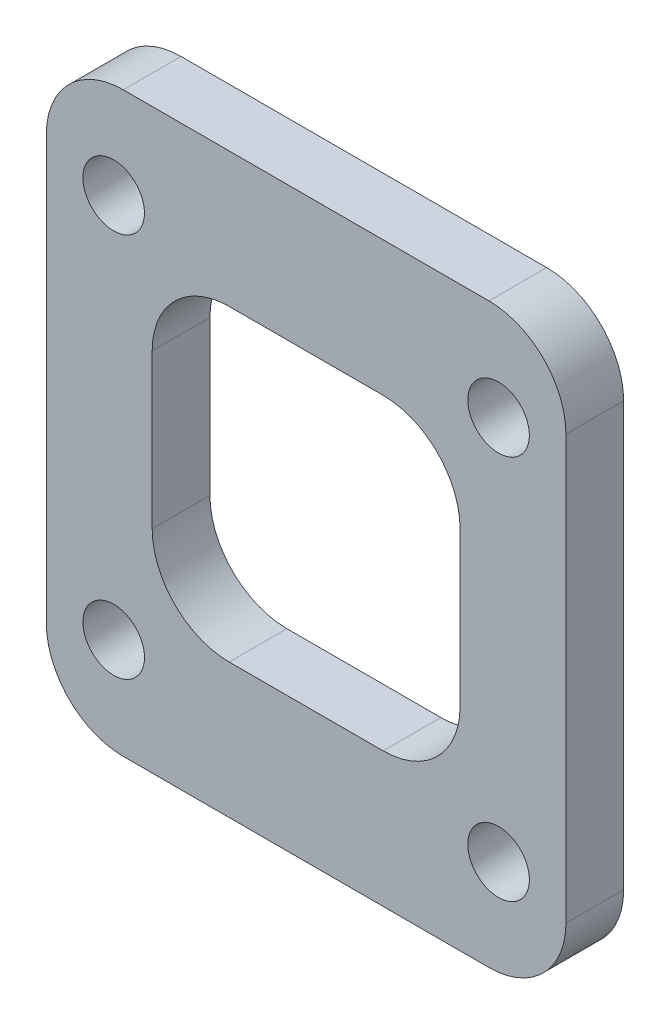
ISO-10303-21;
HEADER;
FILE_DESCRIPTION(('STEP AP214'),'2;1');
FILE_NAME('part.step','',(''),(''),'','','');
FILE_SCHEMA(('AUTOMOTIVE_DESIGN { 1 0 10303 214 1 1 1 1 }'));
ENDSEC;
DATA;
#1=APPLICATION_CONTEXT('core data for automotive mechanical design processes');
#2=APPLICATION_PROTOCOL_DEFINITION('international standard','automotive_design',2000,#1);
#3=PRODUCT_CONTEXT('',#1,'mechanical');
#4=PRODUCT('Part','Part','',(#3));
#5=PRODUCT_RELATED_PRODUCT_CATEGORY('part','',(#4));
#6=PRODUCT_DEFINITION_FORMATION('','',#4);
#7=PRODUCT_DEFINITION_CONTEXT('part definition',#1,'design');
#8=PRODUCT_DEFINITION('design','',#6,#7);
#9=PRODUCT_DEFINITION_SHAPE('','',#8);
#10=(LENGTH_UNIT() NAMED_UNIT(*) SI_UNIT(.MILLI.,.METRE.));
#11=(NAMED_UNIT(*) PLANE_ANGLE_UNIT() SI_UNIT($,.RADIAN.));
#12=(NAMED_UNIT(*) SI_UNIT($,.STERADIAN.) SOLID_ANGLE_UNIT());
#13=UNCERTAINTY_MEASURE_WITH_UNIT(LENGTH_MEASURE(1.E-05),#10,'distance_accuracy_value','');
#14=(GEOMETRIC_REPRESENTATION_CONTEXT(3) GLOBAL_UNCERTAINTY_ASSIGNED_CONTEXT((#13)) GLOBAL_UNIT_ASSIGNED_CONTEXT((#10,
#11,#12)) REPRESENTATION_CONTEXT('',''));
#15=CARTESIAN_POINT('',(0.,0.,0.));
#16=DIRECTION('',(0.,0.,1.));
#17=DIRECTION('',(1.,0.,0.));
#18=AXIS2_PLACEMENT_3D('',#15,#16,#17);
#19=CARTESIAN_POINT('',(0.,0.,3.));
#20=DIRECTION('',(0.,0.,-1.));
#21=DIRECTION('',(-1.,0.,0.));
#22=AXIS2_PLACEMENT_3D('',#19,#20,#21);
#23=PLANE('',#22);
#24=DIRECTION('',(-1.,0.,0.));
#25=VECTOR('',#24,1.);
#26=CARTESIAN_POINT('',(-8.,8.,3.));
#27=LINE('',#26,#25);
#28=CARTESIAN_POINT('',(4.,8.,3.));
#29=VERTEX_POINT('',#28);
#30=CARTESIAN_POINT('',(-4.,8.,3.));
#31=VERTEX_POINT('',#30);
#32=EDGE_CURVE('E243',#29,#31,#27,.T.);
#33=ORIENTED_EDGE('',*,*,#32,.F.);
#34=CARTESIAN_POINT('',(4.,4.,3.));
#35=DIRECTION('',(0.,0.,-1.));
#36=DIRECTION('',(-1.,0.,0.));
#37=AXIS2_PLACEMENT_3D('',#34,#35,#36);
#38=CIRCLE('',#37,4.);
#39=CARTESIAN_POINT('',(8.,4.,3.));
#40=VERTEX_POINT('',#39);
#41=EDGE_CURVE('E236',#29,#40,#38,.T.);
#42=ORIENTED_EDGE('',*,*,#41,.T.);
#43=DIRECTION('',(0.,1.,0.));
#44=VECTOR('',#43,1.);
#45=CARTESIAN_POINT('',(8.,-8.,3.));
#46=LINE('',#45,#44);
#47=CARTESIAN_POINT('',(8.,-4.,3.));
#48=VERTEX_POINT('',#47);
#49=EDGE_CURVE('E254',#48,#40,#46,.T.);
#50=ORIENTED_EDGE('',*,*,#49,.F.);
#51=CARTESIAN_POINT('',(4.,-4.,3.));
#52=DIRECTION('',(0.,0.,-1.));
#53=DIRECTION('',(-1.,0.,0.));
#54=AXIS2_PLACEMENT_3D('',#51,#52,#53);
#55=CIRCLE('',#54,4.);
#56=CARTESIAN_POINT('',(4.,-8.,3.));
#57=VERTEX_POINT('',#56);
#58=EDGE_CURVE('E228',#48,#57,#55,.T.);
#59=ORIENTED_EDGE('',*,*,#58,.T.);
#60=DIRECTION('',(1.,0.,0.));
#61=VECTOR('',#60,1.);
#62=CARTESIAN_POINT('',(-8.,-8.,3.));
#63=LINE('',#62,#61);
#64=CARTESIAN_POINT('',(-4.,-8.,3.));
#65=VERTEX_POINT('',#64);
#66=EDGE_CURVE('E279',#65,#57,#63,.T.);
#67=ORIENTED_EDGE('',*,*,#66,.F.);
#68=CARTESIAN_POINT('',(-4.,-4.,3.));
#69=DIRECTION('',(0.,0.,-1.));
#70=DIRECTION('',(-1.,0.,0.));
#71=AXIS2_PLACEMENT_3D('',#68,#69,#70);
#72=CIRCLE('',#71,4.);
#73=CARTESIAN_POINT('',(-8.,-4.,3.));
#74=VERTEX_POINT('',#73);
#75=EDGE_CURVE('E232',#65,#74,#72,.T.);
#76=ORIENTED_EDGE('',*,*,#75,.T.);
#77=DIRECTION('',(0.,-1.,0.));
#78=VECTOR('',#77,1.);
#79=CARTESIAN_POINT('',(-8.,-8.,3.));
#80=LINE('',#79,#78);
#81=CARTESIAN_POINT('',(-8.,4.,3.));
#82=VERTEX_POINT('',#81);
#83=EDGE_CURVE('E245',#82,#74,#80,.T.);
#84=ORIENTED_EDGE('',*,*,#83,.F.);
#85=CARTESIAN_POINT('',(-4.,4.,3.));
#86=DIRECTION('',(0.,0.,-1.));
#87=DIRECTION('',(-1.,0.,0.));
#88=AXIS2_PLACEMENT_3D('',#85,#86,#87);
#89=CIRCLE('',#88,4.);
#90=EDGE_CURVE('E42',#82,#31,#89,.T.);
#91=ORIENTED_EDGE('',*,*,#90,.T.);
#92=EDGE_LOOP('',(#33,#42,#50,#59,#67,#76,#84,#91));
#93=FACE_BOUND('',#92,.T.);
#94=DIRECTION('',(0.,-1.,0.));
#95=VECTOR('',#94,1.);
#96=CARTESIAN_POINT('',(-13.5,-15.,3.));
#97=LINE('',#96,#95);
#98=CARTESIAN_POINT('',(-13.5,11.,3.));
#99=VERTEX_POINT('',#98);
#100=CARTESIAN_POINT('',(-13.5,-11.,3.));
#101=VERTEX_POINT('',#100);
#102=EDGE_CURVE('E307',#99,#101,#97,.T.);
#103=ORIENTED_EDGE('',*,*,#102,.T.);
#104=CARTESIAN_POINT('',(-9.5,-11.,3.));
#105=DIRECTION('',(0.,0.,-1.));
#106=DIRECTION('',(-1.,0.,0.));
#107=AXIS2_PLACEMENT_3D('',#104,#105,#106);
#108=CIRCLE('',#107,4.);
#109=CARTESIAN_POINT('',(-9.5,-15.,3.));
#110=VERTEX_POINT('',#109);
#111=EDGE_CURVE('E197',#101,#110,#108,.F.);
#112=ORIENTED_EDGE('',*,*,#111,.T.);
#113=DIRECTION('',(1.,0.,0.));
#114=VECTOR('',#113,1.);
#115=CARTESIAN_POINT('',(-13.5,-15.,3.));
#116=LINE('',#115,#114);
#117=CARTESIAN_POINT('',(9.5,-15.,3.));
#118=VERTEX_POINT('',#117);
#119=EDGE_CURVE('E168',#110,#118,#116,.T.);
#120=ORIENTED_EDGE('',*,*,#119,.T.);
#121=CARTESIAN_POINT('',(9.5,-11.,3.));
#122=DIRECTION('',(0.,0.,-1.));
#123=DIRECTION('',(-1.,0.,0.));
#124=AXIS2_PLACEMENT_3D('',#121,#122,#123);
#125=CIRCLE('',#124,4.);
#126=CARTESIAN_POINT('',(13.5,-11.,3.));
#127=VERTEX_POINT('',#126);
#128=EDGE_CURVE('E195',#118,#127,#125,.F.);
#129=ORIENTED_EDGE('',*,*,#128,.T.);
#130=DIRECTION('',(0.,1.,0.));
#131=VECTOR('',#130,1.);
#132=CARTESIAN_POINT('',(13.5,-15.,3.));
#133=LINE('',#132,#131);
#134=CARTESIAN_POINT('',(13.5,11.,3.));
#135=VERTEX_POINT('',#134);
#136=EDGE_CURVE('E175',#127,#135,#133,.T.);
#137=ORIENTED_EDGE('',*,*,#136,.T.);
#138=CARTESIAN_POINT('',(9.5,11.,3.));
#139=DIRECTION('',(0.,0.,-1.));
#140=DIRECTION('',(-1.,0.,0.));
#141=AXIS2_PLACEMENT_3D('',#138,#139,#140);
#142=CIRCLE('',#141,4.);
#143=CARTESIAN_POINT('',(9.5,15.,3.));
#144=VERTEX_POINT('',#143);
#145=EDGE_CURVE('E56',#135,#144,#142,.F.);
#146=ORIENTED_EDGE('',*,*,#145,.T.);
#147=DIRECTION('',(-1.,0.,0.));
#148=VECTOR('',#147,1.);
#149=CARTESIAN_POINT('',(-13.5,15.,3.));
#150=LINE('',#149,#148);
#151=CARTESIAN_POINT('',(-9.5,15.,3.));
#152=VERTEX_POINT('',#151);
#153=EDGE_CURVE('E178',#144,#152,#150,.T.);
#154=ORIENTED_EDGE('',*,*,#153,.T.);
#155=CARTESIAN_POINT('',(-9.5,11.,3.));
#156=DIRECTION('',(0.,0.,-1.));
#157=DIRECTION('',(-1.,0.,0.));
#158=AXIS2_PLACEMENT_3D('',#155,#156,#157);
#159=CIRCLE('',#158,4.);
#160=EDGE_CURVE('E192',#152,#99,#159,.F.);
#161=ORIENTED_EDGE('',*,*,#160,.T.);
#162=EDGE_LOOP('',(#103,#112,#120,#129,#137,#146,#154,#161));
#163=FACE_BOUND('',#162,.T.);
#164=CARTESIAN_POINT('',(10.,-10.,3.));
#165=DIRECTION('',(0.,0.,1.));
#166=DIRECTION('',(-1.,0.,0.));
#167=AXIS2_PLACEMENT_3D('',#164,#165,#166);
#168=CIRCLE('',#167,1.6);
#169=CARTESIAN_POINT('',(8.4,-10.,3.));
#170=VERTEX_POINT('',#169);
#171=EDGE_CURVE('E300',#170,#170,#168,.T.);
#172=ORIENTED_EDGE('',*,*,#171,.F.);
#173=EDGE_LOOP('',(#172));
#174=FACE_BOUND('',#173,.T.);
#175=CARTESIAN_POINT('',(10.,10.,3.));
#176=DIRECTION('',(0.,0.,1.));
#177=DIRECTION('',(1.,0.,0.));
#178=AXIS2_PLACEMENT_3D('',#175,#176,#177);
#179=CIRCLE('',#178,1.6);
#180=CARTESIAN_POINT('',(11.6,10.,3.));
#181=VERTEX_POINT('',#180);
#182=EDGE_CURVE('E294',#181,#181,#179,.T.);
#183=ORIENTED_EDGE('',*,*,#182,.F.);
#184=EDGE_LOOP('',(#183));
#185=FACE_BOUND('',#184,.T.);
#186=CARTESIAN_POINT('',(-10.,-10.,3.));
#187=DIRECTION('',(0.,0.,1.));
#188=DIRECTION('',(1.,0.,0.));
#189=AXIS2_PLACEMENT_3D('',#186,#187,#188);
#190=CIRCLE('',#189,1.6);
#191=CARTESIAN_POINT('',(-8.4,-10.,3.));
#192=VERTEX_POINT('',#191);
#193=EDGE_CURVE('E288',#192,#192,#190,.T.);
#194=ORIENTED_EDGE('',*,*,#193,.F.);
#195=EDGE_LOOP('',(#194));
#196=FACE_BOUND('',#195,.T.);
#197=CARTESIAN_POINT('',(-10.,10.,3.));
#198=DIRECTION('',(0.,0.,1.));
#199=DIRECTION('',(-1.,0.,0.));
#200=AXIS2_PLACEMENT_3D('',#197,#198,#199);
#201=CIRCLE('',#200,1.6);
#202=CARTESIAN_POINT('',(-11.6,10.,3.));
#203=VERTEX_POINT('',#202);
#204=EDGE_CURVE('E282',#203,#203,#201,.T.);
#205=ORIENTED_EDGE('',*,*,#204,.F.);
#206=EDGE_LOOP('',(#205));
#207=FACE_BOUND('',#206,.T.);
#208=ADVANCED_FACE('F34',(#93,#163,#174,#185,#196,#207),#23,.F.);
#209=CARTESIAN_POINT('',(0.,0.,0.));
#210=DIRECTION('',(0.,0.,-1.));
#211=DIRECTION('',(-1.,0.,0.));
#212=AXIS2_PLACEMENT_3D('',#209,#210,#211);
#213=PLANE('',#212);
#214=DIRECTION('',(1.,0.,0.));
#215=VECTOR('',#214,1.);
#216=CARTESIAN_POINT('',(-8.,-8.,0.));
#217=LINE('',#216,#215);
#218=CARTESIAN_POINT('',(-4.,-8.,0.));
#219=VERTEX_POINT('',#218);
#220=CARTESIAN_POINT('',(4.,-8.,0.));
#221=VERTEX_POINT('',#220);
#222=EDGE_CURVE('E268',#219,#221,#217,.T.);
#223=ORIENTED_EDGE('',*,*,#222,.T.);
#224=CARTESIAN_POINT('',(4.,-4.,0.));
#225=DIRECTION('',(0.,0.,-1.));
#226=DIRECTION('',(-1.,0.,0.));
#227=AXIS2_PLACEMENT_3D('',#224,#225,#226);
#228=CIRCLE('',#227,4.);
#229=CARTESIAN_POINT('',(8.,-4.,0.));
#230=VERTEX_POINT('',#229);
#231=EDGE_CURVE('E230',#221,#230,#228,.F.);
#232=ORIENTED_EDGE('',*,*,#231,.T.);
#233=DIRECTION('',(0.,1.,0.));
#234=VECTOR('',#233,1.);
#235=CARTESIAN_POINT('',(8.,-8.,0.));
#236=LINE('',#235,#234);
#237=CARTESIAN_POINT('',(8.,4.,0.));
#238=VERTEX_POINT('',#237);
#239=EDGE_CURVE('E272',#230,#238,#236,.T.);
#240=ORIENTED_EDGE('',*,*,#239,.T.);
#241=CARTESIAN_POINT('',(4.,4.,0.));
#242=DIRECTION('',(0.,0.,-1.));
#243=DIRECTION('',(-1.,0.,0.));
#244=AXIS2_PLACEMENT_3D('',#241,#242,#243);
#245=CIRCLE('',#244,4.);
#246=CARTESIAN_POINT('',(4.,8.,0.));
#247=VERTEX_POINT('',#246);
#248=EDGE_CURVE('E238',#238,#247,#245,.F.);
#249=ORIENTED_EDGE('',*,*,#248,.T.);
#250=DIRECTION('',(-1.,0.,0.));
#251=VECTOR('',#250,1.);
#252=CARTESIAN_POINT('',(-8.,8.,0.));
#253=LINE('',#252,#251);
#254=CARTESIAN_POINT('',(-4.,8.,0.));
#255=VERTEX_POINT('',#254);
#256=EDGE_CURVE('E264',#247,#255,#253,.T.);
#257=ORIENTED_EDGE('',*,*,#256,.T.);
#258=CARTESIAN_POINT('',(-4.,4.,0.));
#259=DIRECTION('',(0.,0.,-1.));
#260=DIRECTION('',(-1.,0.,0.));
#261=AXIS2_PLACEMENT_3D('',#258,#259,#260);
#262=CIRCLE('',#261,4.);
#263=CARTESIAN_POINT('',(-8.,4.,0.));
#264=VERTEX_POINT('',#263);
#265=EDGE_CURVE('E11',#255,#264,#262,.F.);
#266=ORIENTED_EDGE('',*,*,#265,.T.);
#267=DIRECTION('',(0.,-1.,0.));
#268=VECTOR('',#267,1.);
#269=CARTESIAN_POINT('',(-8.,-8.,0.));
#270=LINE('',#269,#268);
#271=CARTESIAN_POINT('',(-8.,-4.,0.));
#272=VERTEX_POINT('',#271);
#273=EDGE_CURVE('E262',#264,#272,#270,.T.);
#274=ORIENTED_EDGE('',*,*,#273,.T.);
#275=CARTESIAN_POINT('',(-4.,-4.,0.));
#276=DIRECTION('',(0.,0.,-1.));
#277=DIRECTION('',(-1.,0.,0.));
#278=AXIS2_PLACEMENT_3D('',#275,#276,#277);
#279=CIRCLE('',#278,4.);
#280=EDGE_CURVE('E234',#272,#219,#279,.F.);
#281=ORIENTED_EDGE('',*,*,#280,.T.);
#282=EDGE_LOOP('',(#223,#232,#240,#249,#257,#266,#274,#281));
#283=FACE_BOUND('',#282,.T.);
#284=CARTESIAN_POINT('',(-10.,-10.,0.));
#285=DIRECTION('',(0.,0.,1.));
#286=DIRECTION('',(1.,0.,0.));
#287=AXIS2_PLACEMENT_3D('',#284,#285,#286);
#288=CIRCLE('',#287,1.6);
#289=CARTESIAN_POINT('',(-8.4,-10.,0.));
#290=VERTEX_POINT('',#289);
#291=EDGE_CURVE('E285',#290,#290,#288,.T.);
#292=ORIENTED_EDGE('',*,*,#291,.T.);
#293=EDGE_LOOP('',(#292));
#294=FACE_BOUND('',#293,.T.);
#295=CARTESIAN_POINT('',(10.,-10.,0.));
#296=DIRECTION('',(0.,0.,1.));
#297=DIRECTION('',(-1.,0.,0.));
#298=AXIS2_PLACEMENT_3D('',#295,#296,#297);
#299=CIRCLE('',#298,1.6);
#300=CARTESIAN_POINT('',(8.4,-10.,0.));
#301=VERTEX_POINT('',#300);
#302=EDGE_CURVE('E297',#301,#301,#299,.T.);
#303=ORIENTED_EDGE('',*,*,#302,.T.);
#304=EDGE_LOOP('',(#303));
#305=FACE_BOUND('',#304,.T.);
#306=DIRECTION('',(1.,0.,0.));
#307=VECTOR('',#306,1.);
#308=CARTESIAN_POINT('',(-13.5,-15.,0.));
#309=LINE('',#308,#307);
#310=CARTESIAN_POINT('',(-9.5,-15.,0.));
#311=VERTEX_POINT('',#310);
#312=CARTESIAN_POINT('',(9.5,-15.,0.));
#313=VERTEX_POINT('',#312);
#314=EDGE_CURVE('E165',#311,#313,#309,.T.);
#315=ORIENTED_EDGE('',*,*,#314,.F.);
#316=CARTESIAN_POINT('',(-9.5,-11.,0.));
#317=DIRECTION('',(0.,0.,-1.));
#318=DIRECTION('',(-1.,0.,0.));
#319=AXIS2_PLACEMENT_3D('',#316,#317,#318);
#320=CIRCLE('',#319,4.);
#321=CARTESIAN_POINT('',(-13.5,-11.,0.));
#322=VERTEX_POINT('',#321);
#323=EDGE_CURVE('E148',#311,#322,#320,.T.);
#324=ORIENTED_EDGE('',*,*,#323,.T.);
#325=DIRECTION('',(0.,-1.,0.));
#326=VECTOR('',#325,1.);
#327=CARTESIAN_POINT('',(-13.5,-15.,0.));
#328=LINE('',#327,#326);
#329=CARTESIAN_POINT('',(-13.5,11.,0.));
#330=VERTEX_POINT('',#329);
#331=EDGE_CURVE('E176',#330,#322,#328,.T.);
#332=ORIENTED_EDGE('',*,*,#331,.F.);
#333=CARTESIAN_POINT('',(-9.5,11.,0.));
#334=DIRECTION('',(0.,0.,-1.));
#335=DIRECTION('',(-1.,0.,0.));
#336=AXIS2_PLACEMENT_3D('',#333,#334,#335);
#337=CIRCLE('',#336,4.);
#338=CARTESIAN_POINT('',(-9.5,15.,0.));
#339=VERTEX_POINT('',#338);
#340=EDGE_CURVE('E169',#330,#339,#337,.T.);
#341=ORIENTED_EDGE('',*,*,#340,.T.);
#342=DIRECTION('',(-1.,0.,0.));
#343=VECTOR('',#342,1.);
#344=CARTESIAN_POINT('',(-13.5,15.,0.));
#345=LINE('',#344,#343);
#346=CARTESIAN_POINT('',(9.5,15.,0.));
#347=VERTEX_POINT('',#346);
#348=EDGE_CURVE('E180',#347,#339,#345,.T.);
#349=ORIENTED_EDGE('',*,*,#348,.F.);
#350=CARTESIAN_POINT('',(9.5,11.,0.));
#351=DIRECTION('',(0.,0.,-1.));
#352=DIRECTION('',(-1.,0.,0.));
#353=AXIS2_PLACEMENT_3D('',#350,#351,#352);
#354=CIRCLE('',#353,4.);
#355=CARTESIAN_POINT('',(13.5,11.,0.));
#356=VERTEX_POINT('',#355);
#357=EDGE_CURVE('E186',#347,#356,#354,.T.);
#358=ORIENTED_EDGE('',*,*,#357,.T.);
#359=DIRECTION('',(0.,1.,0.));
#360=VECTOR('',#359,1.);
#361=CARTESIAN_POINT('',(13.5,-15.,0.));
#362=LINE('',#361,#360);
#363=CARTESIAN_POINT('',(13.5,-11.,0.));
#364=VERTEX_POINT('',#363);
#365=EDGE_CURVE('E303',#364,#356,#362,.T.);
#366=ORIENTED_EDGE('',*,*,#365,.F.);
#367=CARTESIAN_POINT('',(9.5,-11.,0.));
#368=DIRECTION('',(0.,0.,-1.));
#369=DIRECTION('',(-1.,0.,0.));
#370=AXIS2_PLACEMENT_3D('',#367,#368,#369);
#371=CIRCLE('',#370,4.);
#372=EDGE_CURVE('E159',#364,#313,#371,.T.);
#373=ORIENTED_EDGE('',*,*,#372,.T.);
#374=EDGE_LOOP('',(#315,#324,#332,#341,#349,#358,#366,#373));
#375=FACE_BOUND('',#374,.T.);
#376=CARTESIAN_POINT('',(10.,10.,0.));
#377=DIRECTION('',(0.,0.,1.));
#378=DIRECTION('',(1.,0.,0.));
#379=AXIS2_PLACEMENT_3D('',#376,#377,#378);
#380=CIRCLE('',#379,1.6);
#381=CARTESIAN_POINT('',(11.6,10.,0.));
#382=VERTEX_POINT('',#381);
#383=EDGE_CURVE('E291',#382,#382,#380,.T.);
#384=ORIENTED_EDGE('',*,*,#383,.T.);
#385=EDGE_LOOP('',(#384));
#386=FACE_BOUND('',#385,.T.);
#387=CARTESIAN_POINT('',(-10.,10.,0.));
#388=DIRECTION('',(0.,0.,1.));
#389=DIRECTION('',(-1.,0.,0.));
#390=AXIS2_PLACEMENT_3D('',#387,#388,#389);
#391=CIRCLE('',#390,1.6);
#392=CARTESIAN_POINT('',(-11.6,10.,0.));
#393=VERTEX_POINT('',#392);
#394=EDGE_CURVE('E270',#393,#393,#391,.T.);
#395=ORIENTED_EDGE('',*,*,#394,.T.);
#396=EDGE_LOOP('',(#395));
#397=FACE_BOUND('',#396,.T.);
#398=ADVANCED_FACE('F172',(#283,#294,#305,#375,#386,#397),#213,.T.);
#399=CARTESIAN_POINT('',(13.5,-15.,3.));
#400=DIRECTION('',(-1.,0.,0.));
#401=DIRECTION('',(0.,0.,1.));
#402=AXIS2_PLACEMENT_3D('',#399,#400,#401);
#403=PLANE('',#402);
#404=ORIENTED_EDGE('',*,*,#136,.F.);
#405=DIRECTION('',(0.,0.,-1.));
#406=VECTOR('',#405,1.);
#407=CARTESIAN_POINT('',(13.5,-11.,3.));
#408=LINE('',#407,#406);
#409=EDGE_CURVE('E201',#127,#364,#408,.T.);
#410=ORIENTED_EDGE('',*,*,#409,.T.);
#411=ORIENTED_EDGE('',*,*,#365,.T.);
#412=DIRECTION('',(0.,0.,-1.));
#413=VECTOR('',#412,1.);
#414=CARTESIAN_POINT('',(13.5,11.,3.));
#415=LINE('',#414,#413);
#416=EDGE_CURVE('E199',#356,#135,#415,.F.);
#417=ORIENTED_EDGE('',*,*,#416,.T.);
#418=EDGE_LOOP('',(#404,#410,#411,#417));
#419=FACE_BOUND('',#418,.T.);
#420=ADVANCED_FACE('F331',(#419),#403,.F.);
#421=CARTESIAN_POINT('',(-13.5,15.,3.));
#422=DIRECTION('',(0.,-1.,0.));
#423=DIRECTION('',(0.,0.,-1.));
#424=AXIS2_PLACEMENT_3D('',#421,#422,#423);
#425=PLANE('',#424);
#426=ORIENTED_EDGE('',*,*,#153,.F.);
#427=DIRECTION('',(0.,0.,-1.));
#428=VECTOR('',#427,1.);
#429=CARTESIAN_POINT('',(9.5,15.,3.));
#430=LINE('',#429,#428);
#431=EDGE_CURVE('E205',#144,#347,#430,.T.);
#432=ORIENTED_EDGE('',*,*,#431,.T.);
#433=ORIENTED_EDGE('',*,*,#348,.T.);
#434=DIRECTION('',(0.,0.,-1.));
#435=VECTOR('',#434,1.);
#436=CARTESIAN_POINT('',(-9.5,15.,3.));
#437=LINE('',#436,#435);
#438=EDGE_CURVE('E49',#339,#152,#437,.F.);
#439=ORIENTED_EDGE('',*,*,#438,.T.);
#440=EDGE_LOOP('',(#426,#432,#433,#439));
#441=FACE_BOUND('',#440,.T.);
#442=ADVANCED_FACE('F313',(#441),#425,.F.);
#443=CARTESIAN_POINT('',(-13.5,-15.,3.));
#444=DIRECTION('',(1.,0.,0.));
#445=DIRECTION('',(0.,0.,-1.));
#446=AXIS2_PLACEMENT_3D('',#443,#444,#445);
#447=PLANE('',#446);
#448=ORIENTED_EDGE('',*,*,#331,.T.);
#449=DIRECTION('',(0.,0.,-1.));
#450=VECTOR('',#449,1.);
#451=CARTESIAN_POINT('',(-13.5,-11.,3.));
#452=LINE('',#451,#450);
#453=EDGE_CURVE('E153',#322,#101,#452,.F.);
#454=ORIENTED_EDGE('',*,*,#453,.T.);
#455=ORIENTED_EDGE('',*,*,#102,.F.);
#456=DIRECTION('',(0.,0.,-1.));
#457=VECTOR('',#456,1.);
#458=CARTESIAN_POINT('',(-13.5,11.,3.));
#459=LINE('',#458,#457);
#460=EDGE_CURVE('E158',#99,#330,#459,.T.);
#461=ORIENTED_EDGE('',*,*,#460,.T.);
#462=EDGE_LOOP('',(#448,#454,#455,#461));
#463=FACE_BOUND('',#462,.T.);
#464=ADVANCED_FACE('F322',(#463),#447,.F.);
#465=CARTESIAN_POINT('',(-13.5,-15.,3.));
#466=DIRECTION('',(0.,1.,0.));
#467=DIRECTION('',(0.,0.,1.));
#468=AXIS2_PLACEMENT_3D('',#465,#466,#467);
#469=PLANE('',#468);
#470=ORIENTED_EDGE('',*,*,#119,.F.);
#471=DIRECTION('',(0.,0.,-1.));
#472=VECTOR('',#471,1.);
#473=CARTESIAN_POINT('',(-9.5,-15.,3.));
#474=LINE('',#473,#472);
#475=EDGE_CURVE('E152',#110,#311,#474,.T.);
#476=ORIENTED_EDGE('',*,*,#475,.T.);
#477=ORIENTED_EDGE('',*,*,#314,.T.);
#478=DIRECTION('',(0.,0.,-1.));
#479=VECTOR('',#478,1.);
#480=CARTESIAN_POINT('',(9.5,-15.,3.));
#481=LINE('',#480,#479);
#482=EDGE_CURVE('E170',#313,#118,#481,.F.);
#483=ORIENTED_EDGE('',*,*,#482,.T.);
#484=EDGE_LOOP('',(#470,#476,#477,#483));
#485=FACE_BOUND('',#484,.T.);
#486=ADVANCED_FACE('F164',(#485),#469,.F.);
#487=CARTESIAN_POINT('',(10.,-10.,3.));
#488=DIRECTION('',(0.,0.,-1.));
#489=DIRECTION('',(-1.,0.,0.));
#490=AXIS2_PLACEMENT_3D('',#487,#488,#489);
#491=CYLINDRICAL_SURFACE('',#490,1.6);
#492=ORIENTED_EDGE('',*,*,#171,.T.);
#493=EDGE_LOOP('',(#492));
#494=FACE_BOUND('',#493,.T.);
#495=ORIENTED_EDGE('',*,*,#302,.F.);
#496=EDGE_LOOP('',(#495));
#497=FACE_BOUND('',#496,.T.);
#498=ADVANCED_FACE('F329',(#494,#497),#491,.F.);
#499=CARTESIAN_POINT('',(10.,10.,3.));
#500=DIRECTION('',(0.,0.,-1.));
#501=DIRECTION('',(-1.,0.,0.));
#502=AXIS2_PLACEMENT_3D('',#499,#500,#501);
#503=CYLINDRICAL_SURFACE('',#502,1.6);
#504=ORIENTED_EDGE('',*,*,#182,.T.);
#505=EDGE_LOOP('',(#504));
#506=FACE_BOUND('',#505,.T.);
#507=ORIENTED_EDGE('',*,*,#383,.F.);
#508=EDGE_LOOP('',(#507));
#509=FACE_BOUND('',#508,.T.);
#510=ADVANCED_FACE('F342',(#506,#509),#503,.F.);
#511=CARTESIAN_POINT('',(-10.,-10.,3.));
#512=DIRECTION('',(0.,0.,-1.));
#513=DIRECTION('',(-1.,0.,0.));
#514=AXIS2_PLACEMENT_3D('',#511,#512,#513);
#515=CYLINDRICAL_SURFACE('',#514,1.6);
#516=ORIENTED_EDGE('',*,*,#193,.T.);
#517=EDGE_LOOP('',(#516));
#518=FACE_BOUND('',#517,.T.);
#519=ORIENTED_EDGE('',*,*,#291,.F.);
#520=EDGE_LOOP('',(#519));
#521=FACE_BOUND('',#520,.T.);
#522=ADVANCED_FACE('F346',(#518,#521),#515,.F.);
#523=CARTESIAN_POINT('',(-10.,10.,3.));
#524=DIRECTION('',(0.,0.,-1.));
#525=DIRECTION('',(-1.,0.,0.));
#526=AXIS2_PLACEMENT_3D('',#523,#524,#525);
#527=CYLINDRICAL_SURFACE('',#526,1.6);
#528=ORIENTED_EDGE('',*,*,#204,.T.);
#529=EDGE_LOOP('',(#528));
#530=FACE_BOUND('',#529,.T.);
#531=ORIENTED_EDGE('',*,*,#394,.F.);
#532=EDGE_LOOP('',(#531));
#533=FACE_BOUND('',#532,.T.);
#534=ADVANCED_FACE('F350',(#530,#533),#527,.F.);
#535=CARTESIAN_POINT('',(8.,-8.,0.));
#536=DIRECTION('',(1.,0.,0.));
#537=DIRECTION('',(0.,0.,-1.));
#538=AXIS2_PLACEMENT_3D('',#535,#536,#537);
#539=PLANE('',#538);
#540=ORIENTED_EDGE('',*,*,#239,.F.);
#541=DIRECTION('',(0.,0.,1.));
#542=VECTOR('',#541,1.);
#543=CARTESIAN_POINT('',(8.,-4.,3.));
#544=LINE('',#543,#542);
#545=EDGE_CURVE('E210',#230,#48,#544,.T.);
#546=ORIENTED_EDGE('',*,*,#545,.T.);
#547=ORIENTED_EDGE('',*,*,#49,.T.);
#548=DIRECTION('',(0.,0.,1.));
#549=VECTOR('',#548,1.);
#550=CARTESIAN_POINT('',(8.,4.,0.));
#551=LINE('',#550,#549);
#552=EDGE_CURVE('E208',#40,#238,#551,.F.);
#553=ORIENTED_EDGE('',*,*,#552,.T.);
#554=EDGE_LOOP('',(#540,#546,#547,#553));
#555=FACE_BOUND('',#554,.T.);
#556=ADVANCED_FACE('F354',(#555),#539,.F.);
#557=CARTESIAN_POINT('',(-8.,-8.,0.));
#558=DIRECTION('',(0.,-1.,0.));
#559=DIRECTION('',(0.,0.,-1.));
#560=AXIS2_PLACEMENT_3D('',#557,#558,#559);
#561=PLANE('',#560);
#562=ORIENTED_EDGE('',*,*,#66,.T.);
#563=DIRECTION('',(0.,0.,1.));
#564=VECTOR('',#563,1.);
#565=CARTESIAN_POINT('',(4.,-8.,0.));
#566=LINE('',#565,#564);
#567=EDGE_CURVE('E216',#57,#221,#566,.F.);
#568=ORIENTED_EDGE('',*,*,#567,.T.);
#569=ORIENTED_EDGE('',*,*,#222,.F.);
#570=DIRECTION('',(0.,0.,1.));
#571=VECTOR('',#570,1.);
#572=CARTESIAN_POINT('',(-4.,-8.,3.));
#573=LINE('',#572,#571);
#574=EDGE_CURVE('E213',#219,#65,#573,.T.);
#575=ORIENTED_EDGE('',*,*,#574,.T.);
#576=EDGE_LOOP('',(#562,#568,#569,#575));
#577=FACE_BOUND('',#576,.T.);
#578=ADVANCED_FACE('F358',(#577),#561,.F.);
#579=CARTESIAN_POINT('',(-8.,-8.,0.));
#580=DIRECTION('',(-1.,0.,0.));
#581=DIRECTION('',(0.,0.,1.));
#582=AXIS2_PLACEMENT_3D('',#579,#580,#581);
#583=PLANE('',#582);
#584=ORIENTED_EDGE('',*,*,#83,.T.);
#585=DIRECTION('',(0.,0.,1.));
#586=VECTOR('',#585,1.);
#587=CARTESIAN_POINT('',(-8.,-4.,0.));
#588=LINE('',#587,#586);
#589=EDGE_CURVE('E221',#74,#272,#588,.F.);
#590=ORIENTED_EDGE('',*,*,#589,.T.);
#591=ORIENTED_EDGE('',*,*,#273,.F.);
#592=DIRECTION('',(0.,0.,1.));
#593=VECTOR('',#592,1.);
#594=CARTESIAN_POINT('',(-8.,4.,3.));
#595=LINE('',#594,#593);
#596=EDGE_CURVE('E218',#264,#82,#595,.T.);
#597=ORIENTED_EDGE('',*,*,#596,.T.);
#598=EDGE_LOOP('',(#584,#590,#591,#597));
#599=FACE_BOUND('',#598,.T.);
#600=ADVANCED_FACE('F266',(#599),#583,.F.);
#601=CARTESIAN_POINT('',(-8.,8.,0.));
#602=DIRECTION('',(0.,1.,0.));
#603=DIRECTION('',(0.,0.,1.));
#604=AXIS2_PLACEMENT_3D('',#601,#602,#603);
#605=PLANE('',#604);
#606=ORIENTED_EDGE('',*,*,#256,.F.);
#607=DIRECTION('',(0.,0.,1.));
#608=VECTOR('',#607,1.);
#609=CARTESIAN_POINT('',(4.,8.,3.));
#610=LINE('',#609,#608);
#611=EDGE_CURVE('E225',#247,#29,#610,.T.);
#612=ORIENTED_EDGE('',*,*,#611,.T.);
#613=ORIENTED_EDGE('',*,*,#32,.T.);
#614=DIRECTION('',(0.,0.,1.));
#615=VECTOR('',#614,1.);
#616=CARTESIAN_POINT('',(-4.,8.,0.));
#617=LINE('',#616,#615);
#618=EDGE_CURVE('E223',#31,#255,#617,.F.);
#619=ORIENTED_EDGE('',*,*,#618,.T.);
#620=EDGE_LOOP('',(#606,#612,#613,#619));
#621=FACE_BOUND('',#620,.T.);
#622=ADVANCED_FACE('F251',(#621),#605,.F.);
#623=CARTESIAN_POINT('',(-9.5,-11.,3.));
#624=DIRECTION('',(0.,0.,-1.));
#625=DIRECTION('',(-1.,0.,0.));
#626=AXIS2_PLACEMENT_3D('',#623,#624,#625);
#627=CYLINDRICAL_SURFACE('',#626,4.);
#628=ORIENTED_EDGE('',*,*,#111,.F.);
#629=ORIENTED_EDGE('',*,*,#453,.F.);
#630=ORIENTED_EDGE('',*,*,#323,.F.);
#631=ORIENTED_EDGE('',*,*,#475,.F.);
#632=EDGE_LOOP('',(#628,#629,#630,#631));
#633=FACE_BOUND('',#632,.T.);
#634=ADVANCED_FACE('F151',(#633),#627,.T.);
#635=CARTESIAN_POINT('',(9.5,-11.,3.));
#636=DIRECTION('',(0.,0.,-1.));
#637=DIRECTION('',(-1.,0.,0.));
#638=AXIS2_PLACEMENT_3D('',#635,#636,#637);
#639=CYLINDRICAL_SURFACE('',#638,4.);
#640=ORIENTED_EDGE('',*,*,#128,.F.);
#641=ORIENTED_EDGE('',*,*,#482,.F.);
#642=ORIENTED_EDGE('',*,*,#372,.F.);
#643=ORIENTED_EDGE('',*,*,#409,.F.);
#644=EDGE_LOOP('',(#640,#641,#642,#643));
#645=FACE_BOUND('',#644,.T.);
#646=ADVANCED_FACE('F399',(#645),#639,.T.);
#647=CARTESIAN_POINT('',(9.5,11.,3.));
#648=DIRECTION('',(0.,0.,-1.));
#649=DIRECTION('',(-1.,0.,0.));
#650=AXIS2_PLACEMENT_3D('',#647,#648,#649);
#651=CYLINDRICAL_SURFACE('',#650,4.);
#652=ORIENTED_EDGE('',*,*,#145,.F.);
#653=ORIENTED_EDGE('',*,*,#416,.F.);
#654=ORIENTED_EDGE('',*,*,#357,.F.);
#655=ORIENTED_EDGE('',*,*,#431,.F.);
#656=EDGE_LOOP('',(#652,#653,#654,#655));
#657=FACE_BOUND('',#656,.T.);
#658=ADVANCED_FACE('F396',(#657),#651,.T.);
#659=CARTESIAN_POINT('',(-9.5,11.,3.));
#660=DIRECTION('',(0.,0.,-1.));
#661=DIRECTION('',(-1.,0.,0.));
#662=AXIS2_PLACEMENT_3D('',#659,#660,#661);
#663=CYLINDRICAL_SURFACE('',#662,4.);
#664=ORIENTED_EDGE('',*,*,#160,.F.);
#665=ORIENTED_EDGE('',*,*,#438,.F.);
#666=ORIENTED_EDGE('',*,*,#340,.F.);
#667=ORIENTED_EDGE('',*,*,#460,.F.);
#668=EDGE_LOOP('',(#664,#665,#666,#667));
#669=FACE_BOUND('',#668,.T.);
#670=ADVANCED_FACE('F317',(#669),#663,.T.);
#671=CARTESIAN_POINT('',(4.,-4.,0.));
#672=DIRECTION('',(0.,0.,-1.));
#673=DIRECTION('',(-1.,0.,0.));
#674=AXIS2_PLACEMENT_3D('',#671,#672,#673);
#675=CYLINDRICAL_SURFACE('',#674,4.);
#676=ORIENTED_EDGE('',*,*,#231,.F.);
#677=ORIENTED_EDGE('',*,*,#567,.F.);
#678=ORIENTED_EDGE('',*,*,#58,.F.);
#679=ORIENTED_EDGE('',*,*,#545,.F.);
#680=EDGE_LOOP('',(#676,#677,#678,#679));
#681=FACE_BOUND('',#680,.T.);
#682=ADVANCED_FACE('F374',(#681),#675,.F.);
#683=CARTESIAN_POINT('',(-4.,-4.,0.));
#684=DIRECTION('',(0.,0.,-1.));
#685=DIRECTION('',(-1.,0.,0.));
#686=AXIS2_PLACEMENT_3D('',#683,#684,#685);
#687=CYLINDRICAL_SURFACE('',#686,4.);
#688=ORIENTED_EDGE('',*,*,#280,.F.);
#689=ORIENTED_EDGE('',*,*,#589,.F.);
#690=ORIENTED_EDGE('',*,*,#75,.F.);
#691=ORIENTED_EDGE('',*,*,#574,.F.);
#692=EDGE_LOOP('',(#688,#689,#690,#691));
#693=FACE_BOUND('',#692,.T.);
#694=ADVANCED_FACE('F384',(#693),#687,.F.);
#695=CARTESIAN_POINT('',(4.,4.,0.));
#696=DIRECTION('',(0.,0.,-1.));
#697=DIRECTION('',(-1.,0.,0.));
#698=AXIS2_PLACEMENT_3D('',#695,#696,#697);
#699=CYLINDRICAL_SURFACE('',#698,4.);
#700=ORIENTED_EDGE('',*,*,#248,.F.);
#701=ORIENTED_EDGE('',*,*,#552,.F.);
#702=ORIENTED_EDGE('',*,*,#41,.F.);
#703=ORIENTED_EDGE('',*,*,#611,.F.);
#704=EDGE_LOOP('',(#700,#701,#702,#703));
#705=FACE_BOUND('',#704,.T.);
#706=ADVANCED_FACE('F382',(#705),#699,.F.);
#707=CARTESIAN_POINT('',(-4.,4.,0.));
#708=DIRECTION('',(0.,0.,-1.));
#709=DIRECTION('',(-1.,0.,0.));
#710=AXIS2_PLACEMENT_3D('',#707,#708,#709);
#711=CYLINDRICAL_SURFACE('',#710,4.);
#712=ORIENTED_EDGE('',*,*,#265,.F.);
#713=ORIENTED_EDGE('',*,*,#618,.F.);
#714=ORIENTED_EDGE('',*,*,#90,.F.);
#715=ORIENTED_EDGE('',*,*,#596,.F.);
#716=EDGE_LOOP('',(#712,#713,#714,#715));
#717=FACE_BOUND('',#716,.T.);
#718=ADVANCED_FACE('F36',(#717),#711,.F.);
#719=CLOSED_SHELL('',(#208,#398,#420,#442,#464,#486,#498,#510,#522,#534,#556,#578,#600,#622,
#634,#646,#658,#670,#682,#694,#706,#718));
#720=MANIFOLD_SOLID_BREP('B2',#719);
#721=ADVANCED_BREP_SHAPE_REPRESENTATION('',(#18,#720),#14);
#722=SHAPE_DEFINITION_REPRESENTATION(#9,#721);
ENDSEC;
END-ISO-10303-21;
